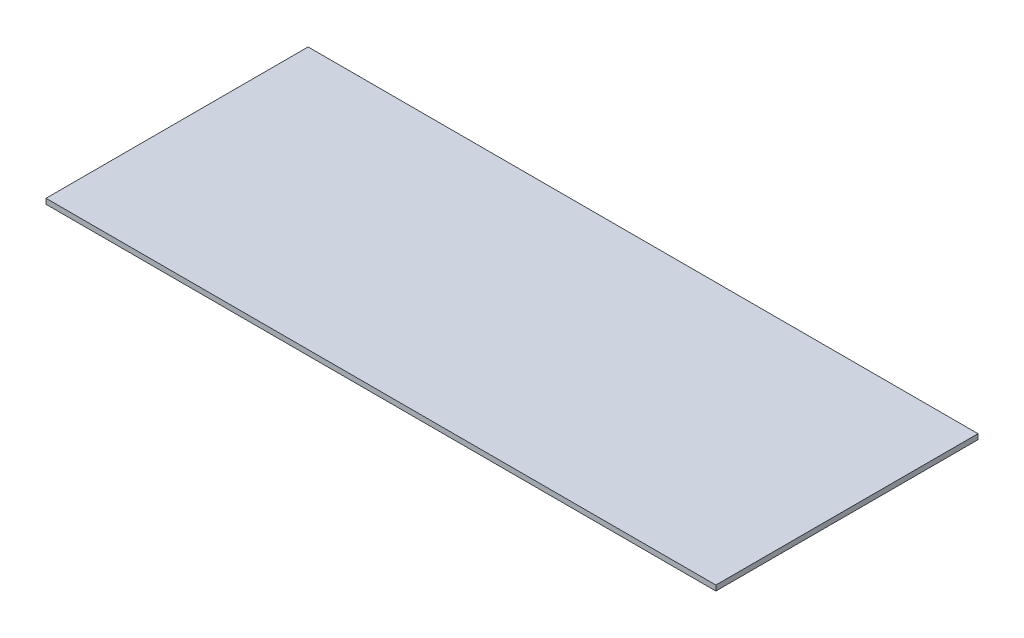
ISO-10303-21;
HEADER;
FILE_DESCRIPTION(('STEP AP214'),'2;1');
FILE_NAME('part.step','',(''),(''),'','','');
FILE_SCHEMA(('AUTOMOTIVE_DESIGN { 1 0 10303 214 1 1 1 1 }'));
ENDSEC;
DATA;
#1=APPLICATION_CONTEXT('core data for automotive mechanical design processes');
#2=APPLICATION_PROTOCOL_DEFINITION('international standard','automotive_design',2000,#1);
#3=PRODUCT_CONTEXT('',#1,'mechanical');
#4=PRODUCT('Part','Part','',(#3));
#5=PRODUCT_RELATED_PRODUCT_CATEGORY('part','',(#4));
#6=PRODUCT_DEFINITION_FORMATION('','',#4);
#7=PRODUCT_DEFINITION_CONTEXT('part definition',#1,'design');
#8=PRODUCT_DEFINITION('design','',#6,#7);
#9=PRODUCT_DEFINITION_SHAPE('','',#8);
#10=(LENGTH_UNIT() NAMED_UNIT(*) SI_UNIT(.MILLI.,.METRE.));
#11=(NAMED_UNIT(*) PLANE_ANGLE_UNIT() SI_UNIT($,.RADIAN.));
#12=(NAMED_UNIT(*) SI_UNIT($,.STERADIAN.) SOLID_ANGLE_UNIT());
#13=UNCERTAINTY_MEASURE_WITH_UNIT(LENGTH_MEASURE(1.E-05),#10,'distance_accuracy_value','');
#14=(GEOMETRIC_REPRESENTATION_CONTEXT(3) GLOBAL_UNCERTAINTY_ASSIGNED_CONTEXT((#13)) GLOBAL_UNIT_ASSIGNED_CONTEXT((#10,
#11,#12)) REPRESENTATION_CONTEXT('',''));
#15=CARTESIAN_POINT('',(0.,0.,0.));
#16=DIRECTION('',(0.,0.,1.));
#17=DIRECTION('',(1.,0.,0.));
#18=AXIS2_PLACEMENT_3D('',#15,#16,#17);
#19=CARTESIAN_POINT('',(0.,18.,0.));
#20=DIRECTION('',(1.,0.,0.));
#21=DIRECTION('',(0.,0.,-1.));
#22=AXIS2_PLACEMENT_3D('',#19,#20,#21);
#23=PLANE('',#22);
#24=DIRECTION('',(0.,0.,1.));
#25=VECTOR('',#24,1.);
#26=CARTESIAN_POINT('',(0.,0.,0.));
#27=LINE('',#26,#25);
#28=CARTESIAN_POINT('',(0.,0.,-900.));
#29=VERTEX_POINT('',#28);
#30=CARTESIAN_POINT('',(0.,0.,0.));
#31=VERTEX_POINT('',#30);
#32=EDGE_CURVE('E96',#29,#31,#27,.T.);
#33=ORIENTED_EDGE('',*,*,#32,.T.);
#34=DIRECTION('',(0.,-1.,0.));
#35=VECTOR('',#34,1.);
#36=CARTESIAN_POINT('',(0.,18.,0.));
#37=LINE('',#36,#35);
#38=CARTESIAN_POINT('',(0.,18.,0.));
#39=VERTEX_POINT('',#38);
#40=EDGE_CURVE('E11',#39,#31,#37,.T.);
#41=ORIENTED_EDGE('',*,*,#40,.F.);
#42=DIRECTION('',(0.,0.,1.));
#43=VECTOR('',#42,1.);
#44=CARTESIAN_POINT('',(0.,18.,0.));
#45=LINE('',#44,#43);
#46=CARTESIAN_POINT('',(0.,18.,-900.));
#47=VERTEX_POINT('',#46);
#48=EDGE_CURVE('E84',#47,#39,#45,.T.);
#49=ORIENTED_EDGE('',*,*,#48,.F.);
#50=DIRECTION('',(0.,-1.,0.));
#51=VECTOR('',#50,1.);
#52=CARTESIAN_POINT('',(0.,18.,-900.));
#53=LINE('',#52,#51);
#54=EDGE_CURVE('E92',#47,#29,#53,.T.);
#55=ORIENTED_EDGE('',*,*,#54,.T.);
#56=EDGE_LOOP('',(#33,#41,#49,#55));
#57=FACE_BOUND('',#56,.T.);
#58=ADVANCED_FACE('F33',(#57),#23,.F.);
#59=CARTESIAN_POINT('',(0.,18.,0.));
#60=DIRECTION('',(0.,0.,-1.));
#61=DIRECTION('',(-1.,0.,0.));
#62=AXIS2_PLACEMENT_3D('',#59,#60,#61);
#63=PLANE('',#62);
#64=DIRECTION('',(1.,0.,0.));
#65=VECTOR('',#64,1.);
#66=CARTESIAN_POINT('',(0.,0.,0.));
#67=LINE('',#66,#65);
#68=CARTESIAN_POINT('',(2300.,0.,0.));
#69=VERTEX_POINT('',#68);
#70=EDGE_CURVE('E88',#31,#69,#67,.T.);
#71=ORIENTED_EDGE('',*,*,#70,.T.);
#72=DIRECTION('',(0.,-1.,0.));
#73=VECTOR('',#72,1.);
#74=CARTESIAN_POINT('',(2300.,18.,0.));
#75=LINE('',#74,#73);
#76=CARTESIAN_POINT('',(2300.,18.,0.));
#77=VERTEX_POINT('',#76);
#78=EDGE_CURVE('E41',#77,#69,#75,.T.);
#79=ORIENTED_EDGE('',*,*,#78,.F.);
#80=DIRECTION('',(1.,0.,0.));
#81=VECTOR('',#80,1.);
#82=CARTESIAN_POINT('',(0.,18.,0.));
#83=LINE('',#82,#81);
#84=EDGE_CURVE('E79',#39,#77,#83,.T.);
#85=ORIENTED_EDGE('',*,*,#84,.F.);
#86=ORIENTED_EDGE('',*,*,#40,.T.);
#87=EDGE_LOOP('',(#71,#79,#85,#86));
#88=FACE_BOUND('',#87,.T.);
#89=ADVANCED_FACE('F87',(#88),#63,.F.);
#90=CARTESIAN_POINT('',(2300.,18.,0.));
#91=DIRECTION('',(-1.,0.,0.));
#92=DIRECTION('',(0.,0.,1.));
#93=AXIS2_PLACEMENT_3D('',#90,#91,#92);
#94=PLANE('',#93);
#95=DIRECTION('',(0.,0.,-1.));
#96=VECTOR('',#95,1.);
#97=CARTESIAN_POINT('',(2300.,0.,0.));
#98=LINE('',#97,#96);
#99=CARTESIAN_POINT('',(2300.,0.,-900.));
#100=VERTEX_POINT('',#99);
#101=EDGE_CURVE('E66',#69,#100,#98,.T.);
#102=ORIENTED_EDGE('',*,*,#101,.T.);
#103=DIRECTION('',(0.,-1.,0.));
#104=VECTOR('',#103,1.);
#105=CARTESIAN_POINT('',(2300.,18.,-900.));
#106=LINE('',#105,#104);
#107=CARTESIAN_POINT('',(2300.,18.,-900.));
#108=VERTEX_POINT('',#107);
#109=EDGE_CURVE('E89',#108,#100,#106,.T.);
#110=ORIENTED_EDGE('',*,*,#109,.F.);
#111=DIRECTION('',(0.,0.,-1.));
#112=VECTOR('',#111,1.);
#113=CARTESIAN_POINT('',(2300.,18.,0.));
#114=LINE('',#113,#112);
#115=EDGE_CURVE('E82',#77,#108,#114,.T.);
#116=ORIENTED_EDGE('',*,*,#115,.F.);
#117=ORIENTED_EDGE('',*,*,#78,.T.);
#118=EDGE_LOOP('',(#102,#110,#116,#117));
#119=FACE_BOUND('',#118,.T.);
#120=ADVANCED_FACE('F90',(#119),#94,.F.);
#121=CARTESIAN_POINT('',(0.,18.,-900.));
#122=DIRECTION('',(0.,0.,1.));
#123=DIRECTION('',(1.,0.,0.));
#124=AXIS2_PLACEMENT_3D('',#121,#122,#123);
#125=PLANE('',#124);
#126=DIRECTION('',(-1.,0.,0.));
#127=VECTOR('',#126,1.);
#128=CARTESIAN_POINT('',(0.,0.,-900.));
#129=LINE('',#128,#127);
#130=EDGE_CURVE('E72',#100,#29,#129,.T.);
#131=ORIENTED_EDGE('',*,*,#130,.T.);
#132=ORIENTED_EDGE('',*,*,#54,.F.);
#133=DIRECTION('',(-1.,0.,0.));
#134=VECTOR('',#133,1.);
#135=CARTESIAN_POINT('',(0.,18.,-900.));
#136=LINE('',#135,#134);
#137=EDGE_CURVE('E49',#108,#47,#136,.T.);
#138=ORIENTED_EDGE('',*,*,#137,.F.);
#139=ORIENTED_EDGE('',*,*,#109,.T.);
#140=EDGE_LOOP('',(#131,#132,#138,#139));
#141=FACE_BOUND('',#140,.T.);
#142=ADVANCED_FACE('F103',(#141),#125,.F.);
#143=CARTESIAN_POINT('',(0.,18.,0.));
#144=DIRECTION('',(0.,-1.,0.));
#145=DIRECTION('',(0.,0.,-1.));
#146=AXIS2_PLACEMENT_3D('',#143,#144,#145);
#147=PLANE('',#146);
#148=ORIENTED_EDGE('',*,*,#48,.T.);
#149=ORIENTED_EDGE('',*,*,#84,.T.);
#150=ORIENTED_EDGE('',*,*,#115,.T.);
#151=ORIENTED_EDGE('',*,*,#137,.T.);
#152=EDGE_LOOP('',(#148,#149,#150,#151));
#153=FACE_BOUND('',#152,.T.);
#154=ADVANCED_FACE('F80',(#153),#147,.F.);
#155=CARTESIAN_POINT('',(0.,0.,0.));
#156=DIRECTION('',(0.,-1.,0.));
#157=DIRECTION('',(0.,0.,-1.));
#158=AXIS2_PLACEMENT_3D('',#155,#156,#157);
#159=PLANE('',#158);
#160=ORIENTED_EDGE('',*,*,#32,.F.);
#161=ORIENTED_EDGE('',*,*,#130,.F.);
#162=ORIENTED_EDGE('',*,*,#101,.F.);
#163=ORIENTED_EDGE('',*,*,#70,.F.);
#164=EDGE_LOOP('',(#160,#161,#162,#163));
#165=FACE_BOUND('',#164,.T.);
#166=ADVANCED_FACE('F106',(#165),#159,.T.);
#167=CLOSED_SHELL('',(#58,#89,#120,#142,#154,#166));
#168=MANIFOLD_SOLID_BREP('B2',#167);
#169=ADVANCED_BREP_SHAPE_REPRESENTATION('',(#18,#168),#14);
#170=SHAPE_DEFINITION_REPRESENTATION(#9,#169);
ENDSEC;
END-ISO-10303-21;
